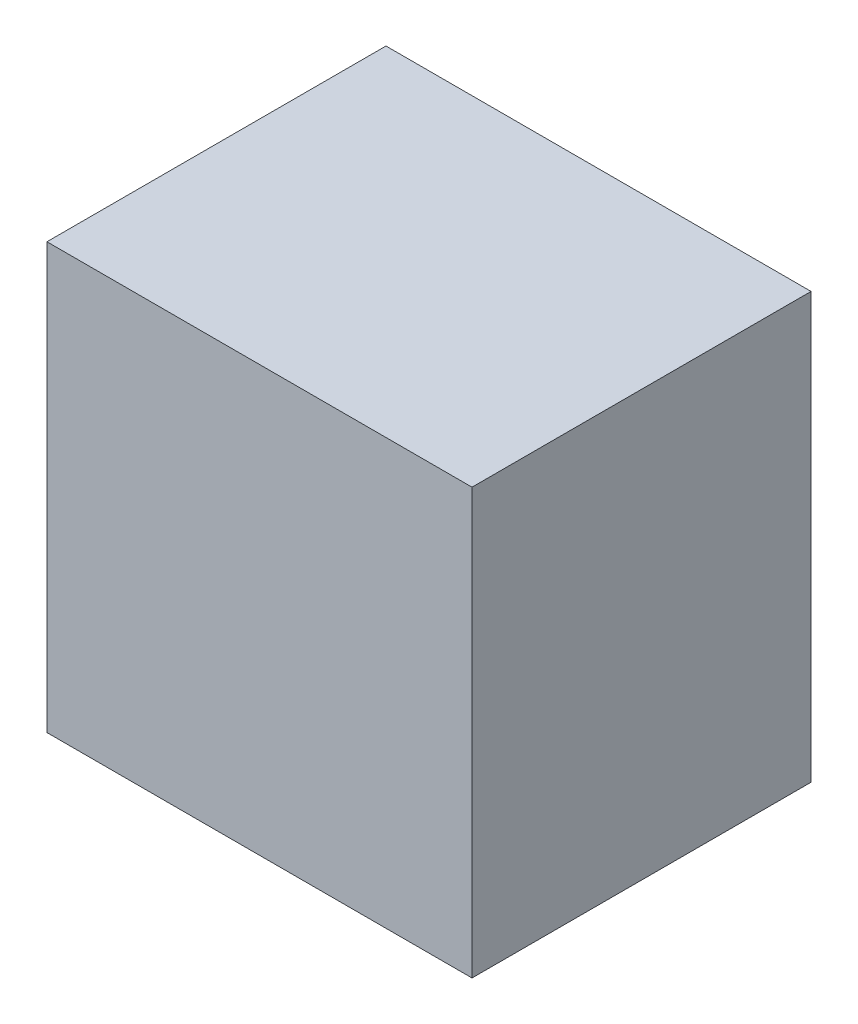
ISO-10303-21;
HEADER;
FILE_DESCRIPTION(('STEP AP214'),'2;1');
FILE_NAME('part.step','',(''),(''),'','','');
FILE_SCHEMA(('AUTOMOTIVE_DESIGN { 1 0 10303 214 1 1 1 1 }'));
ENDSEC;
DATA;
#1=APPLICATION_CONTEXT('core data for automotive mechanical design processes');
#2=APPLICATION_PROTOCOL_DEFINITION('international standard','automotive_design',2000,#1);
#3=PRODUCT_CONTEXT('',#1,'mechanical');
#4=PRODUCT('Part','Part','',(#3));
#5=PRODUCT_RELATED_PRODUCT_CATEGORY('part','',(#4));
#6=PRODUCT_DEFINITION_FORMATION('','',#4);
#7=PRODUCT_DEFINITION_CONTEXT('part definition',#1,'design');
#8=PRODUCT_DEFINITION('design','',#6,#7);
#9=PRODUCT_DEFINITION_SHAPE('','',#8);
#10=(LENGTH_UNIT() NAMED_UNIT(*) SI_UNIT(.MILLI.,.METRE.));
#11=(NAMED_UNIT(*) PLANE_ANGLE_UNIT() SI_UNIT($,.RADIAN.));
#12=(NAMED_UNIT(*) SI_UNIT($,.STERADIAN.) SOLID_ANGLE_UNIT());
#13=UNCERTAINTY_MEASURE_WITH_UNIT(LENGTH_MEASURE(1.E-05),#10,'distance_accuracy_value','');
#14=(GEOMETRIC_REPRESENTATION_CONTEXT(3) GLOBAL_UNCERTAINTY_ASSIGNED_CONTEXT((#13)) GLOBAL_UNIT_ASSIGNED_CONTEXT((#10,
#11,#12)) REPRESENTATION_CONTEXT('',''));
#15=CARTESIAN_POINT('',(0.,0.,0.));
#16=DIRECTION('',(0.,0.,1.));
#17=DIRECTION('',(1.,0.,0.));
#18=AXIS2_PLACEMENT_3D('',#15,#16,#17);
#19=CARTESIAN_POINT('',(-1.003,-1.003,0.051));
#20=DIRECTION('',(0.,-1.,0.));
#21=DIRECTION('',(0.,0.,1.));
#22=AXIS2_PLACEMENT_3D('',#19,#20,#21);
#23=PLANE('',#22);
#24=DIRECTION('',(-1.,0.,0.));
#25=VECTOR('',#24,1.);
#26=CARTESIAN_POINT('',(1.003,-1.003,0.051));
#27=LINE('',#26,#25);
#28=CARTESIAN_POINT('',(1.003,-1.003,0.051));
#29=VERTEX_POINT('',#28);
#30=CARTESIAN_POINT('',(-1.003,-1.003,0.051));
#31=VERTEX_POINT('',#30);
#32=EDGE_CURVE('E11',#29,#31,#27,.T.);
#33=ORIENTED_EDGE('',*,*,#32,.F.);
#34=DIRECTION('',(0.,0.,-1.));
#35=VECTOR('',#34,1.);
#36=CARTESIAN_POINT('',(1.003,-1.003,1.651));
#37=LINE('',#36,#35);
#38=CARTESIAN_POINT('',(1.003,-1.003,1.651));
#39=VERTEX_POINT('',#38);
#40=EDGE_CURVE('E24',#39,#29,#37,.T.);
#41=ORIENTED_EDGE('',*,*,#40,.F.);
#42=DIRECTION('',(1.,0.,0.));
#43=VECTOR('',#42,1.);
#44=CARTESIAN_POINT('',(-1.003,-1.003,1.651));
#45=LINE('',#44,#43);
#46=CARTESIAN_POINT('',(-1.003,-1.003,1.651));
#47=VERTEX_POINT('',#46);
#48=EDGE_CURVE('E88',#47,#39,#45,.T.);
#49=ORIENTED_EDGE('',*,*,#48,.F.);
#50=DIRECTION('',(0.,0.,1.));
#51=VECTOR('',#50,1.);
#52=CARTESIAN_POINT('',(-1.003,-1.003,0.051));
#53=LINE('',#52,#51);
#54=EDGE_CURVE('E77',#31,#47,#53,.T.);
#55=ORIENTED_EDGE('',*,*,#54,.F.);
#56=EDGE_LOOP('',(#33,#41,#49,#55));
#57=FACE_BOUND('',#56,.T.);
#58=ADVANCED_FACE('F17',(#57),#23,.T.);
#59=CARTESIAN_POINT('',(1.003,-1.003,0.051));
#60=DIRECTION('',(1.,0.,0.));
#61=DIRECTION('',(0.,0.,1.));
#62=AXIS2_PLACEMENT_3D('',#59,#60,#61);
#63=PLANE('',#62);
#64=DIRECTION('',(0.,-1.,0.));
#65=VECTOR('',#64,1.);
#66=CARTESIAN_POINT('',(1.003,1.003,0.051));
#67=LINE('',#66,#65);
#68=CARTESIAN_POINT('',(1.003,1.003,0.051));
#69=VERTEX_POINT('',#68);
#70=EDGE_CURVE('E85',#69,#29,#67,.T.);
#71=ORIENTED_EDGE('',*,*,#70,.F.);
#72=DIRECTION('',(0.,0.,-1.));
#73=VECTOR('',#72,1.);
#74=CARTESIAN_POINT('',(1.003,1.003,1.651));
#75=LINE('',#74,#73);
#76=CARTESIAN_POINT('',(1.003,1.003,1.651));
#77=VERTEX_POINT('',#76);
#78=EDGE_CURVE('E83',#77,#69,#75,.T.);
#79=ORIENTED_EDGE('',*,*,#78,.F.);
#80=DIRECTION('',(0.,1.,0.));
#81=VECTOR('',#80,1.);
#82=CARTESIAN_POINT('',(1.003,-1.003,1.651));
#83=LINE('',#82,#81);
#84=EDGE_CURVE('E72',#39,#77,#83,.T.);
#85=ORIENTED_EDGE('',*,*,#84,.F.);
#86=ORIENTED_EDGE('',*,*,#40,.T.);
#87=EDGE_LOOP('',(#71,#79,#85,#86));
#88=FACE_BOUND('',#87,.T.);
#89=ADVANCED_FACE('F90',(#88),#63,.T.);
#90=CARTESIAN_POINT('',(1.003,1.003,0.051));
#91=DIRECTION('',(0.,1.,0.));
#92=DIRECTION('',(0.,0.,1.));
#93=AXIS2_PLACEMENT_3D('',#90,#91,#92);
#94=PLANE('',#93);
#95=DIRECTION('',(1.,0.,0.));
#96=VECTOR('',#95,1.);
#97=CARTESIAN_POINT('',(-1.003,1.003,0.051));
#98=LINE('',#97,#96);
#99=CARTESIAN_POINT('',(-1.003,1.003,0.051));
#100=VERTEX_POINT('',#99);
#101=EDGE_CURVE('E60',#100,#69,#98,.T.);
#102=ORIENTED_EDGE('',*,*,#101,.F.);
#103=DIRECTION('',(0.,0.,-1.));
#104=VECTOR('',#103,1.);
#105=CARTESIAN_POINT('',(-1.003,1.003,1.651));
#106=LINE('',#105,#104);
#107=CARTESIAN_POINT('',(-1.003,1.003,1.651));
#108=VERTEX_POINT('',#107);
#109=EDGE_CURVE('E54',#108,#100,#106,.T.);
#110=ORIENTED_EDGE('',*,*,#109,.F.);
#111=DIRECTION('',(-1.,0.,0.));
#112=VECTOR('',#111,1.);
#113=CARTESIAN_POINT('',(1.003,1.003,1.651));
#114=LINE('',#113,#112);
#115=EDGE_CURVE('E58',#77,#108,#114,.T.);
#116=ORIENTED_EDGE('',*,*,#115,.F.);
#117=ORIENTED_EDGE('',*,*,#78,.T.);
#118=EDGE_LOOP('',(#102,#110,#116,#117));
#119=FACE_BOUND('',#118,.T.);
#120=ADVANCED_FACE('F56',(#119),#94,.T.);
#121=CARTESIAN_POINT('',(-1.003,1.003,0.051));
#122=DIRECTION('',(-1.,0.,0.));
#123=DIRECTION('',(0.,0.,1.));
#124=AXIS2_PLACEMENT_3D('',#121,#122,#123);
#125=PLANE('',#124);
#126=DIRECTION('',(0.,1.,0.));
#127=VECTOR('',#126,1.);
#128=CARTESIAN_POINT('',(-1.003,-1.003,0.051));
#129=LINE('',#128,#127);
#130=EDGE_CURVE('E73',#31,#100,#129,.T.);
#131=ORIENTED_EDGE('',*,*,#130,.F.);
#132=ORIENTED_EDGE('',*,*,#54,.T.);
#133=DIRECTION('',(0.,-1.,0.));
#134=VECTOR('',#133,1.);
#135=CARTESIAN_POINT('',(-1.003,1.003,1.651));
#136=LINE('',#135,#134);
#137=EDGE_CURVE('E70',#108,#47,#136,.T.);
#138=ORIENTED_EDGE('',*,*,#137,.F.);
#139=ORIENTED_EDGE('',*,*,#109,.T.);
#140=EDGE_LOOP('',(#131,#132,#138,#139));
#141=FACE_BOUND('',#140,.T.);
#142=ADVANCED_FACE('F76',(#141),#125,.T.);
#143=CARTESIAN_POINT('',(-1.003,1.003,0.051));
#144=DIRECTION('',(0.,0.,-1.));
#145=DIRECTION('',(0.,1.,0.));
#146=AXIS2_PLACEMENT_3D('',#143,#144,#145);
#147=PLANE('',#146);
#148=ORIENTED_EDGE('',*,*,#101,.T.);
#149=ORIENTED_EDGE('',*,*,#70,.T.);
#150=ORIENTED_EDGE('',*,*,#32,.T.);
#151=ORIENTED_EDGE('',*,*,#130,.T.);
#152=EDGE_LOOP('',(#148,#149,#150,#151));
#153=FACE_BOUND('',#152,.T.);
#154=ADVANCED_FACE('F91',(#153),#147,.T.);
#155=CARTESIAN_POINT('',(-1.003,-1.003,1.651));
#156=DIRECTION('',(0.,0.,1.));
#157=DIRECTION('',(0.,1.,0.));
#158=AXIS2_PLACEMENT_3D('',#155,#156,#157);
#159=PLANE('',#158);
#160=ORIENTED_EDGE('',*,*,#48,.T.);
#161=ORIENTED_EDGE('',*,*,#84,.T.);
#162=ORIENTED_EDGE('',*,*,#115,.T.);
#163=ORIENTED_EDGE('',*,*,#137,.T.);
#164=EDGE_LOOP('',(#160,#161,#162,#163));
#165=FACE_BOUND('',#164,.T.);
#166=ADVANCED_FACE('F69',(#165),#159,.T.);
#167=CLOSED_SHELL('',(#58,#89,#120,#142,#154,#166));
#168=MANIFOLD_SOLID_BREP('B1',#167);
#169=ADVANCED_BREP_SHAPE_REPRESENTATION('',(#18,#168),#14);
#170=SHAPE_DEFINITION_REPRESENTATION(#9,#169);
ENDSEC;
END-ISO-10303-21;
